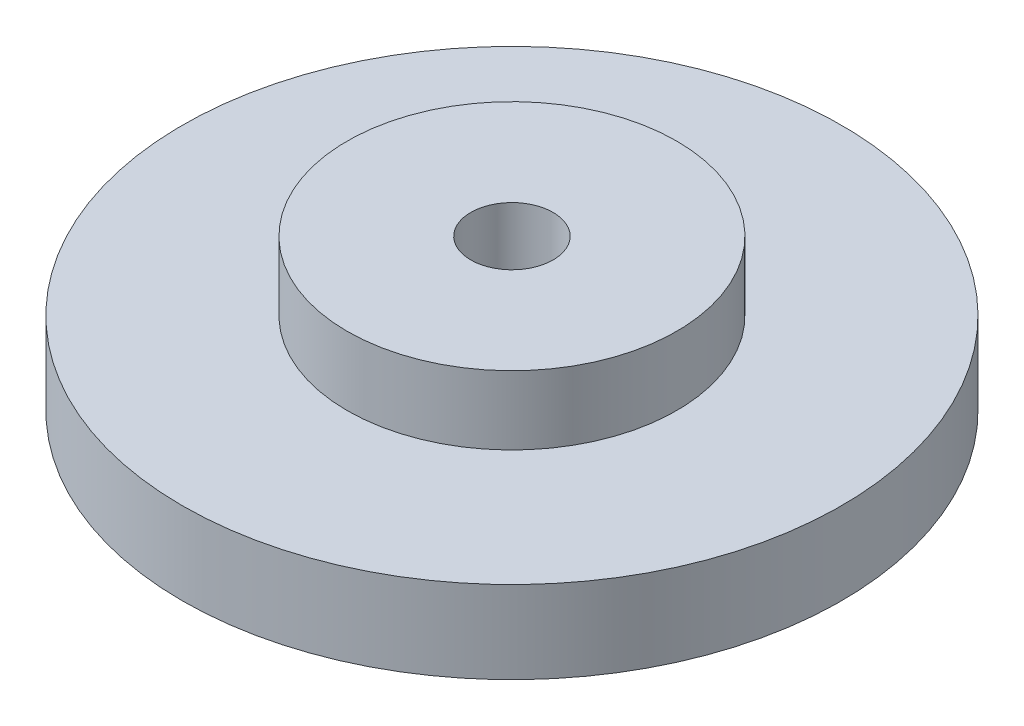
ISO-10303-21;
HEADER;
FILE_DESCRIPTION(('STEP AP214'),'2;1');
FILE_NAME('part.step','',(''),(''),'','','');
FILE_SCHEMA(('AUTOMOTIVE_DESIGN { 1 0 10303 214 1 1 1 1 }'));
ENDSEC;
DATA;
#1=APPLICATION_CONTEXT('core data for automotive mechanical design processes');
#2=APPLICATION_PROTOCOL_DEFINITION('international standard','automotive_design',2000,#1);
#3=PRODUCT_CONTEXT('',#1,'mechanical');
#4=PRODUCT('Part','Part','',(#3));
#5=PRODUCT_RELATED_PRODUCT_CATEGORY('part','',(#4));
#6=PRODUCT_DEFINITION_FORMATION('','',#4);
#7=PRODUCT_DEFINITION_CONTEXT('part definition',#1,'design');
#8=PRODUCT_DEFINITION('design','',#6,#7);
#9=PRODUCT_DEFINITION_SHAPE('','',#8);
#10=(LENGTH_UNIT() NAMED_UNIT(*) SI_UNIT(.MILLI.,.METRE.));
#11=(NAMED_UNIT(*) PLANE_ANGLE_UNIT() SI_UNIT($,.RADIAN.));
#12=(NAMED_UNIT(*) SI_UNIT($,.STERADIAN.) SOLID_ANGLE_UNIT());
#13=UNCERTAINTY_MEASURE_WITH_UNIT(LENGTH_MEASURE(1.E-05),#10,'distance_accuracy_value','');
#14=(GEOMETRIC_REPRESENTATION_CONTEXT(3) GLOBAL_UNCERTAINTY_ASSIGNED_CONTEXT((#13)) GLOBAL_UNIT_ASSIGNED_CONTEXT((#10,
#11,#12)) REPRESENTATION_CONTEXT('',''));
#15=CARTESIAN_POINT('',(0.,0.,0.));
#16=DIRECTION('',(0.,0.,1.));
#17=DIRECTION('',(1.,0.,0.));
#18=AXIS2_PLACEMENT_3D('',#15,#16,#17);
#19=CARTESIAN_POINT('',(0.,12.,0.));
#20=DIRECTION('',(0.,-1.,0.));
#21=DIRECTION('',(0.,0.,-1.));
#22=AXIS2_PLACEMENT_3D('',#19,#20,#21);
#23=CYLINDRICAL_SURFACE('',#22,48.);
#24=CARTESIAN_POINT('',(0.,12.,0.));
#25=DIRECTION('',(0.,1.,0.));
#26=DIRECTION('',(0.,0.,1.));
#27=AXIS2_PLACEMENT_3D('',#24,#25,#26);
#28=CIRCLE('',#27,48.);
#29=CARTESIAN_POINT('',(0.,12.,48.));
#30=VERTEX_POINT('',#29);
#31=EDGE_CURVE('E40',#30,#30,#28,.T.);
#32=ORIENTED_EDGE('',*,*,#31,.F.);
#33=EDGE_LOOP('',(#32));
#34=FACE_BOUND('',#33,.T.);
#35=CARTESIAN_POINT('',(0.,0.,0.));
#36=DIRECTION('',(0.,1.,0.));
#37=DIRECTION('',(0.,0.,1.));
#38=AXIS2_PLACEMENT_3D('',#35,#36,#37);
#39=CIRCLE('',#38,48.);
#40=CARTESIAN_POINT('',(0.,0.,48.));
#41=VERTEX_POINT('',#40);
#42=EDGE_CURVE('E36',#41,#41,#39,.T.);
#43=ORIENTED_EDGE('',*,*,#42,.T.);
#44=EDGE_LOOP('',(#43));
#45=FACE_BOUND('',#44,.T.);
#46=ADVANCED_FACE('F33',(#34,#45),#23,.T.);
#47=CARTESIAN_POINT('',(0.,12.,0.));
#48=DIRECTION('',(0.,1.,0.));
#49=DIRECTION('',(0.,0.,1.));
#50=AXIS2_PLACEMENT_3D('',#47,#48,#49);
#51=PLANE('',#50);
#52=CARTESIAN_POINT('',(0.,12.,0.));
#53=DIRECTION('',(0.,1.,0.));
#54=DIRECTION('',(0.,0.,1.));
#55=AXIS2_PLACEMENT_3D('',#52,#53,#54);
#56=CIRCLE('',#55,24.);
#57=CARTESIAN_POINT('',(0.,12.,24.));
#58=VERTEX_POINT('',#57);
#59=EDGE_CURVE('E10',#58,#58,#56,.T.);
#60=ORIENTED_EDGE('',*,*,#59,.F.);
#61=EDGE_LOOP('',(#60));
#62=FACE_BOUND('',#61,.T.);
#63=ORIENTED_EDGE('',*,*,#31,.T.);
#64=EDGE_LOOP('',(#63));
#65=FACE_BOUND('',#64,.T.);
#66=ADVANCED_FACE('F105',(#62,#65),#51,.T.);
#67=CARTESIAN_POINT('',(0.,0.,0.));
#68=DIRECTION('',(0.,1.,0.));
#69=DIRECTION('',(0.,0.,1.));
#70=AXIS2_PLACEMENT_3D('',#67,#68,#69);
#71=PLANE('',#70);
#72=CARTESIAN_POINT('',(0.,0.,36.));
#73=DIRECTION('',(0.,-1.,0.));
#74=DIRECTION('',(0.,0.,-1.));
#75=AXIS2_PLACEMENT_3D('',#72,#73,#74);
#76=CIRCLE('',#75,4.);
#77=CARTESIAN_POINT('',(0.,0.,32.));
#78=VERTEX_POINT('',#77);
#79=EDGE_CURVE('E81',#78,#78,#76,.T.);
#80=ORIENTED_EDGE('',*,*,#79,.F.);
#81=EDGE_LOOP('',(#80));
#82=FACE_BOUND('',#81,.T.);
#83=CARTESIAN_POINT('',(-31.1769145362394,0.,17.9999999999993));
#84=DIRECTION('',(0.,-1.,0.));
#85=DIRECTION('',(0.,0.,-1.));
#86=AXIS2_PLACEMENT_3D('',#83,#84,#85);
#87=CIRCLE('',#86,4.);
#88=CARTESIAN_POINT('',(-31.1769145362394,0.,13.9999999999993));
#89=VERTEX_POINT('',#88);
#90=EDGE_CURVE('E82',#89,#89,#87,.T.);
#91=ORIENTED_EDGE('',*,*,#90,.F.);
#92=EDGE_LOOP('',(#91));
#93=FACE_BOUND('',#92,.T.);
#94=CARTESIAN_POINT('',(-31.1769145362387,0.,-18.0000000000006));
#95=DIRECTION('',(0.,-1.,0.));
#96=DIRECTION('',(0.,0.,-1.));
#97=AXIS2_PLACEMENT_3D('',#94,#95,#96);
#98=CIRCLE('',#97,4.);
#99=CARTESIAN_POINT('',(-31.1769145362387,0.,-22.0000000000006));
#100=VERTEX_POINT('',#99);
#101=EDGE_CURVE('E56',#100,#100,#98,.T.);
#102=ORIENTED_EDGE('',*,*,#101,.F.);
#103=EDGE_LOOP('',(#102));
#104=FACE_BOUND('',#103,.T.);
#105=CARTESIAN_POINT('',(1.46889464431475E-12,0.,-36.));
#106=DIRECTION('',(0.,-1.,0.));
#107=DIRECTION('',(0.,0.,-1.));
#108=AXIS2_PLACEMENT_3D('',#105,#106,#107);
#109=CIRCLE('',#108,4.);
#110=CARTESIAN_POINT('',(1.46889464431475E-12,0.,-40.));
#111=VERTEX_POINT('',#110);
#112=EDGE_CURVE('E63',#111,#111,#109,.T.);
#113=ORIENTED_EDGE('',*,*,#112,.F.);
#114=EDGE_LOOP('',(#113));
#115=FACE_BOUND('',#114,.T.);
#116=CARTESIAN_POINT('',(31.1769145362409,0.,-17.9999999999994));
#117=DIRECTION('',(0.,-1.,0.));
#118=DIRECTION('',(0.,0.,-1.));
#119=AXIS2_PLACEMENT_3D('',#116,#117,#118);
#120=CIRCLE('',#119,4.);
#121=CARTESIAN_POINT('',(31.1769145362409,0.,-21.9999999999994));
#122=VERTEX_POINT('',#121);
#123=EDGE_CURVE('E69',#122,#122,#120,.T.);
#124=ORIENTED_EDGE('',*,*,#123,.F.);
#125=EDGE_LOOP('',(#124));
#126=FACE_BOUND('',#125,.T.);
#127=CARTESIAN_POINT('',(31.1769145362402,0.,18.0000000000006));
#128=DIRECTION('',(0.,-1.,0.));
#129=DIRECTION('',(0.,0.,-1.));
#130=AXIS2_PLACEMENT_3D('',#127,#128,#129);
#131=CIRCLE('',#130,4.);
#132=CARTESIAN_POINT('',(31.1769145362402,0.,14.0000000000006));
#133=VERTEX_POINT('',#132);
#134=EDGE_CURVE('E75',#133,#133,#131,.T.);
#135=ORIENTED_EDGE('',*,*,#134,.F.);
#136=EDGE_LOOP('',(#135));
#137=FACE_BOUND('',#136,.T.);
#138=CARTESIAN_POINT('',(0.,0.,0.));
#139=DIRECTION('',(0.,1.,0.));
#140=DIRECTION('',(0.,0.,1.));
#141=AXIS2_PLACEMENT_3D('',#138,#139,#140);
#142=CIRCLE('',#141,6.);
#143=CARTESIAN_POINT('',(0.,0.,6.));
#144=VERTEX_POINT('',#143);
#145=EDGE_CURVE('E49',#144,#144,#142,.T.);
#146=ORIENTED_EDGE('',*,*,#145,.T.);
#147=EDGE_LOOP('',(#146));
#148=FACE_BOUND('',#147,.T.);
#149=ORIENTED_EDGE('',*,*,#42,.F.);
#150=EDGE_LOOP('',(#149));
#151=FACE_BOUND('',#150,.T.);
#152=ADVANCED_FACE('F101',(#82,#93,#104,#115,#126,#137,#148,#151),#71,.F.);
#153=CARTESIAN_POINT('',(0.,22.,0.));
#154=DIRECTION('',(0.,-1.,0.));
#155=DIRECTION('',(0.,0.,-1.));
#156=AXIS2_PLACEMENT_3D('',#153,#154,#155);
#157=CYLINDRICAL_SURFACE('',#156,24.);
#158=CARTESIAN_POINT('',(0.,22.,0.));
#159=DIRECTION('',(0.,1.,0.));
#160=DIRECTION('',(0.,0.,1.));
#161=AXIS2_PLACEMENT_3D('',#158,#159,#160);
#162=CIRCLE('',#161,24.);
#163=CARTESIAN_POINT('',(0.,22.,24.));
#164=VERTEX_POINT('',#163);
#165=EDGE_CURVE('E46',#164,#164,#162,.T.);
#166=ORIENTED_EDGE('',*,*,#165,.F.);
#167=EDGE_LOOP('',(#166));
#168=FACE_BOUND('',#167,.T.);
#169=ORIENTED_EDGE('',*,*,#59,.T.);
#170=EDGE_LOOP('',(#169));
#171=FACE_BOUND('',#170,.T.);
#172=ADVANCED_FACE('F104',(#168,#171),#157,.T.);
#173=CARTESIAN_POINT('',(0.,22.,0.));
#174=DIRECTION('',(0.,1.,0.));
#175=DIRECTION('',(0.,0.,1.));
#176=AXIS2_PLACEMENT_3D('',#173,#174,#175);
#177=PLANE('',#176);
#178=CARTESIAN_POINT('',(0.,22.,0.));
#179=DIRECTION('',(0.,1.,0.));
#180=DIRECTION('',(0.,0.,1.));
#181=AXIS2_PLACEMENT_3D('',#178,#179,#180);
#182=CIRCLE('',#181,6.);
#183=CARTESIAN_POINT('',(0.,22.,6.));
#184=VERTEX_POINT('',#183);
#185=EDGE_CURVE('E52',#184,#184,#182,.T.);
#186=ORIENTED_EDGE('',*,*,#185,.F.);
#187=EDGE_LOOP('',(#186));
#188=FACE_BOUND('',#187,.T.);
#189=ORIENTED_EDGE('',*,*,#165,.T.);
#190=EDGE_LOOP('',(#189));
#191=FACE_BOUND('',#190,.T.);
#192=ADVANCED_FACE('F135',(#188,#191),#177,.T.);
#193=CARTESIAN_POINT('',(0.,-12.,0.));
#194=DIRECTION('',(0.,1.,0.));
#195=DIRECTION('',(0.,0.,1.));
#196=AXIS2_PLACEMENT_3D('',#193,#194,#195);
#197=CYLINDRICAL_SURFACE('',#196,6.);
#198=ORIENTED_EDGE('',*,*,#185,.T.);
#199=EDGE_LOOP('',(#198));
#200=FACE_BOUND('',#199,.T.);
#201=ORIENTED_EDGE('',*,*,#145,.F.);
#202=EDGE_LOOP('',(#201));
#203=FACE_BOUND('',#202,.T.);
#204=ADVANCED_FACE('F139',(#200,#203),#197,.F.);
#205=CARTESIAN_POINT('',(31.1769145362402,10.,18.0000000000006));
#206=DIRECTION('',(0.,-1.,0.));
#207=DIRECTION('',(0.,0.,-1.));
#208=AXIS2_PLACEMENT_3D('',#205,#206,#207);
#209=CYLINDRICAL_SURFACE('',#208,4.);
#210=CARTESIAN_POINT('',(31.1769145362402,10.,18.0000000000006));
#211=DIRECTION('',(0.,-1.,0.));
#212=DIRECTION('',(0.,0.,-1.));
#213=AXIS2_PLACEMENT_3D('',#210,#211,#212);
#214=CIRCLE('',#213,4.);
#215=CARTESIAN_POINT('',(31.1769145362402,10.,14.0000000000006));
#216=VERTEX_POINT('',#215);
#217=EDGE_CURVE('E78',#216,#216,#214,.T.);
#218=ORIENTED_EDGE('',*,*,#217,.F.);
#219=EDGE_LOOP('',(#218));
#220=FACE_BOUND('',#219,.T.);
#221=ORIENTED_EDGE('',*,*,#134,.T.);
#222=EDGE_LOOP('',(#221));
#223=FACE_BOUND('',#222,.T.);
#224=ADVANCED_FACE('F143',(#220,#223),#209,.F.);
#225=CARTESIAN_POINT('',(31.1769145362402,10.,18.0000000000006));
#226=DIRECTION('',(0.,-1.,0.));
#227=DIRECTION('',(0.,0.,-1.));
#228=AXIS2_PLACEMENT_3D('',#225,#226,#227);
#229=PLANE('',#228);
#230=ORIENTED_EDGE('',*,*,#217,.T.);
#231=EDGE_LOOP('',(#230));
#232=FACE_BOUND('',#231,.T.);
#233=ADVANCED_FACE('F166',(#232),#229,.T.);
#234=CARTESIAN_POINT('',(31.1769145362409,10.,-17.9999999999994));
#235=DIRECTION('',(0.,-1.,0.));
#236=DIRECTION('',(0.,0.,-1.));
#237=AXIS2_PLACEMENT_3D('',#234,#235,#236);
#238=CYLINDRICAL_SURFACE('',#237,4.);
#239=CARTESIAN_POINT('',(31.1769145362409,10.,-17.9999999999994));
#240=DIRECTION('',(0.,-1.,0.));
#241=DIRECTION('',(0.,0.,-1.));
#242=AXIS2_PLACEMENT_3D('',#239,#240,#241);
#243=CIRCLE('',#242,4.);
#244=CARTESIAN_POINT('',(31.1769145362409,10.,-21.9999999999994));
#245=VERTEX_POINT('',#244);
#246=EDGE_CURVE('E72',#245,#245,#243,.T.);
#247=ORIENTED_EDGE('',*,*,#246,.F.);
#248=EDGE_LOOP('',(#247));
#249=FACE_BOUND('',#248,.T.);
#250=ORIENTED_EDGE('',*,*,#123,.T.);
#251=EDGE_LOOP('',(#250));
#252=FACE_BOUND('',#251,.T.);
#253=ADVANCED_FACE('F163',(#249,#252),#238,.F.);
#254=CARTESIAN_POINT('',(31.1769145362409,10.,-17.9999999999994));
#255=DIRECTION('',(0.,-1.,0.));
#256=DIRECTION('',(0.,0.,-1.));
#257=AXIS2_PLACEMENT_3D('',#254,#255,#256);
#258=PLANE('',#257);
#259=ORIENTED_EDGE('',*,*,#246,.T.);
#260=EDGE_LOOP('',(#259));
#261=FACE_BOUND('',#260,.T.);
#262=ADVANCED_FACE('F158',(#261),#258,.T.);
#263=CARTESIAN_POINT('',(1.46889464431475E-12,10.,-36.));
#264=DIRECTION('',(0.,-1.,0.));
#265=DIRECTION('',(0.,0.,-1.));
#266=AXIS2_PLACEMENT_3D('',#263,#264,#265);
#267=CYLINDRICAL_SURFACE('',#266,4.);
#268=CARTESIAN_POINT('',(1.46889464431475E-12,10.,-36.));
#269=DIRECTION('',(0.,-1.,0.));
#270=DIRECTION('',(0.,0.,-1.));
#271=AXIS2_PLACEMENT_3D('',#268,#269,#270);
#272=CIRCLE('',#271,4.);
#273=CARTESIAN_POINT('',(1.46889464431475E-12,10.,-40.));
#274=VERTEX_POINT('',#273);
#275=EDGE_CURVE('E66',#274,#274,#272,.T.);
#276=ORIENTED_EDGE('',*,*,#275,.F.);
#277=EDGE_LOOP('',(#276));
#278=FACE_BOUND('',#277,.T.);
#279=ORIENTED_EDGE('',*,*,#112,.T.);
#280=EDGE_LOOP('',(#279));
#281=FACE_BOUND('',#280,.T.);
#282=ADVANCED_FACE('F155',(#278,#281),#267,.F.);
#283=CARTESIAN_POINT('',(1.46889464431475E-12,10.,-36.));
#284=DIRECTION('',(0.,-1.,0.));
#285=DIRECTION('',(0.,0.,-1.));
#286=AXIS2_PLACEMENT_3D('',#283,#284,#285);
#287=PLANE('',#286);
#288=ORIENTED_EDGE('',*,*,#275,.T.);
#289=EDGE_LOOP('',(#288));
#290=FACE_BOUND('',#289,.T.);
#291=ADVANCED_FACE('F149',(#290),#287,.T.);
#292=CARTESIAN_POINT('',(-31.1769145362387,10.,-18.0000000000006));
#293=DIRECTION('',(0.,-1.,0.));
#294=DIRECTION('',(0.,0.,-1.));
#295=AXIS2_PLACEMENT_3D('',#292,#293,#294);
#296=CYLINDRICAL_SURFACE('',#295,4.);
#297=CARTESIAN_POINT('',(-31.1769145362387,10.,-18.0000000000006));
#298=DIRECTION('',(0.,-1.,0.));
#299=DIRECTION('',(0.,0.,-1.));
#300=AXIS2_PLACEMENT_3D('',#297,#298,#299);
#301=CIRCLE('',#300,4.);
#302=CARTESIAN_POINT('',(-31.1769145362387,10.,-22.0000000000006));
#303=VERTEX_POINT('',#302);
#304=EDGE_CURVE('E59',#303,#303,#301,.T.);
#305=ORIENTED_EDGE('',*,*,#304,.F.);
#306=EDGE_LOOP('',(#305));
#307=FACE_BOUND('',#306,.T.);
#308=ORIENTED_EDGE('',*,*,#101,.T.);
#309=EDGE_LOOP('',(#308));
#310=FACE_BOUND('',#309,.T.);
#311=ADVANCED_FACE('F145',(#307,#310),#296,.F.);
#312=CARTESIAN_POINT('',(-31.1769145362387,10.,-18.0000000000006));
#313=DIRECTION('',(0.,-1.,0.));
#314=DIRECTION('',(0.,0.,-1.));
#315=AXIS2_PLACEMENT_3D('',#312,#313,#314);
#316=PLANE('',#315);
#317=ORIENTED_EDGE('',*,*,#304,.T.);
#318=EDGE_LOOP('',(#317));
#319=FACE_BOUND('',#318,.T.);
#320=ADVANCED_FACE('F148',(#319),#316,.T.);
#321=CARTESIAN_POINT('',(-31.1769145362394,10.,17.9999999999993));
#322=DIRECTION('',(0.,-1.,0.));
#323=DIRECTION('',(0.,0.,-1.));
#324=AXIS2_PLACEMENT_3D('',#321,#322,#323);
#325=CYLINDRICAL_SURFACE('',#324,4.);
#326=CARTESIAN_POINT('',(-31.1769145362394,10.,17.9999999999993));
#327=DIRECTION('',(0.,-1.,0.));
#328=DIRECTION('',(0.,0.,-1.));
#329=AXIS2_PLACEMENT_3D('',#326,#327,#328);
#330=CIRCLE('',#329,4.);
#331=CARTESIAN_POINT('',(-31.1769145362394,10.,13.9999999999993));
#332=VERTEX_POINT('',#331);
#333=EDGE_CURVE('E60',#332,#332,#330,.T.);
#334=ORIENTED_EDGE('',*,*,#333,.F.);
#335=EDGE_LOOP('',(#334));
#336=FACE_BOUND('',#335,.T.);
#337=ORIENTED_EDGE('',*,*,#90,.T.);
#338=EDGE_LOOP('',(#337));
#339=FACE_BOUND('',#338,.T.);
#340=ADVANCED_FACE('F153',(#336,#339),#325,.F.);
#341=CARTESIAN_POINT('',(-31.1769145362394,10.,17.9999999999993));
#342=DIRECTION('',(0.,-1.,0.));
#343=DIRECTION('',(0.,0.,-1.));
#344=AXIS2_PLACEMENT_3D('',#341,#342,#343);
#345=PLANE('',#344);
#346=ORIENTED_EDGE('',*,*,#333,.T.);
#347=EDGE_LOOP('',(#346));
#348=FACE_BOUND('',#347,.T.);
#349=ADVANCED_FACE('F97',(#348),#345,.T.);
#350=CARTESIAN_POINT('',(0.,10.,36.));
#351=DIRECTION('',(0.,-1.,0.));
#352=DIRECTION('',(0.,0.,-1.));
#353=AXIS2_PLACEMENT_3D('',#350,#351,#352);
#354=CYLINDRICAL_SURFACE('',#353,4.);
#355=CARTESIAN_POINT('',(0.,10.,36.));
#356=DIRECTION('',(0.,-1.,0.));
#357=DIRECTION('',(0.,0.,-1.));
#358=AXIS2_PLACEMENT_3D('',#355,#356,#357);
#359=CIRCLE('',#358,4.);
#360=CARTESIAN_POINT('',(0.,10.,32.));
#361=VERTEX_POINT('',#360);
#362=EDGE_CURVE('E55',#361,#361,#359,.T.);
#363=ORIENTED_EDGE('',*,*,#362,.F.);
#364=EDGE_LOOP('',(#363));
#365=FACE_BOUND('',#364,.T.);
#366=ORIENTED_EDGE('',*,*,#79,.T.);
#367=EDGE_LOOP('',(#366));
#368=FACE_BOUND('',#367,.T.);
#369=ADVANCED_FACE('F94',(#365,#368),#354,.F.);
#370=CARTESIAN_POINT('',(0.,10.,36.));
#371=DIRECTION('',(0.,-1.,0.));
#372=DIRECTION('',(0.,0.,-1.));
#373=AXIS2_PLACEMENT_3D('',#370,#371,#372);
#374=PLANE('',#373);
#375=ORIENTED_EDGE('',*,*,#362,.T.);
#376=EDGE_LOOP('',(#375));
#377=FACE_BOUND('',#376,.T.);
#378=ADVANCED_FACE('F92',(#377),#374,.T.);
#379=CLOSED_SHELL('',(#46,#66,#152,#172,#192,#204,#224,#233,#253,#262,#282,#291,#311,#320,#340,
#349,#369,#378));
#380=MANIFOLD_SOLID_BREP('B2',#379);
#381=ADVANCED_BREP_SHAPE_REPRESENTATION('',(#18,#380),#14);
#382=SHAPE_DEFINITION_REPRESENTATION(#9,#381);
ENDSEC;
END-ISO-10303-21;
